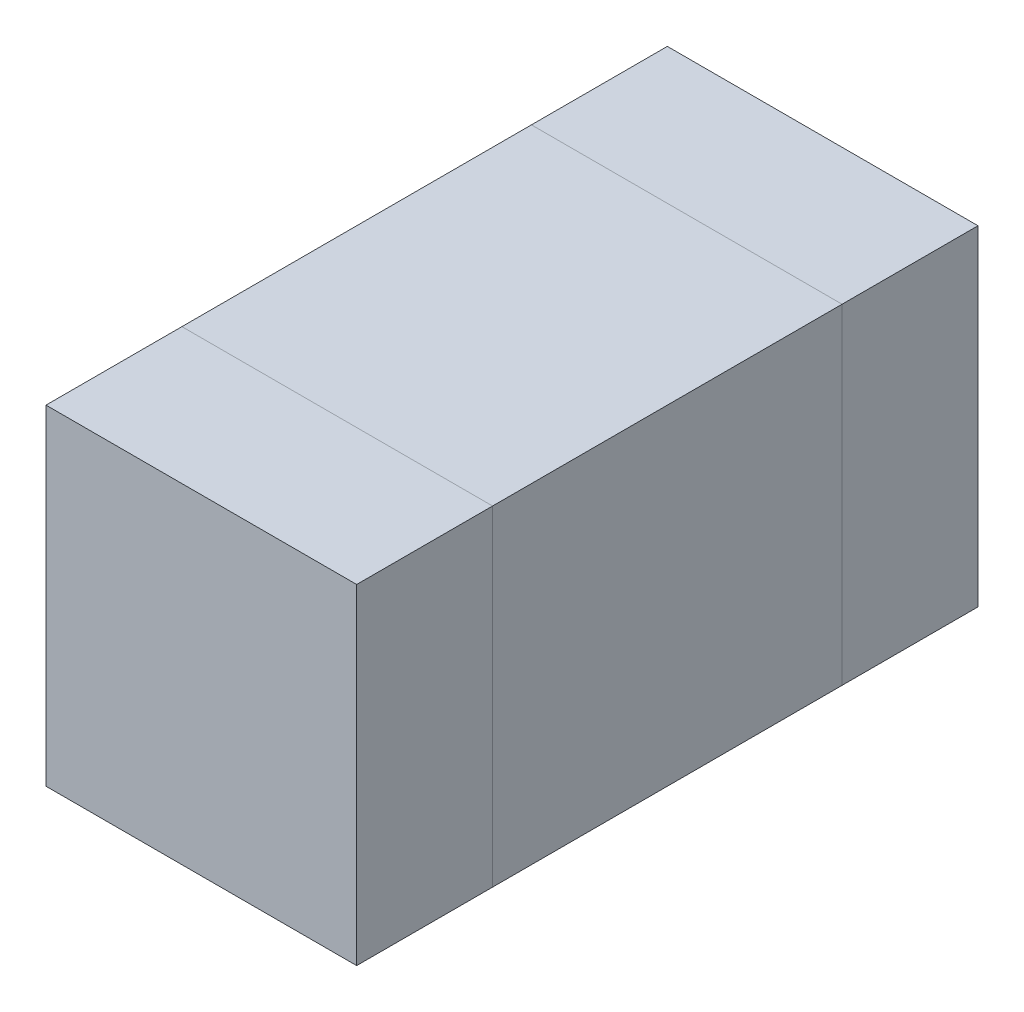
ISO-10303-21;
HEADER;
FILE_DESCRIPTION(('STEP AP214'),'2;1');
FILE_NAME('part.step','',(''),(''),'','','');
FILE_SCHEMA(('AUTOMOTIVE_DESIGN { 1 0 10303 214 1 1 1 1 }'));
ENDSEC;
DATA;
#1=APPLICATION_CONTEXT('core data for automotive mechanical design processes');
#2=APPLICATION_PROTOCOL_DEFINITION('international standard','automotive_design',2000,#1);
#3=PRODUCT_CONTEXT('',#1,'mechanical');
#4=PRODUCT('Part','Part','',(#3));
#5=PRODUCT_RELATED_PRODUCT_CATEGORY('part','',(#4));
#6=PRODUCT_DEFINITION_FORMATION('','',#4);
#7=PRODUCT_DEFINITION_CONTEXT('part definition',#1,'design');
#8=PRODUCT_DEFINITION('design','',#6,#7);
#9=PRODUCT_DEFINITION_SHAPE('','',#8);
#10=(LENGTH_UNIT() NAMED_UNIT(*) SI_UNIT(.MILLI.,.METRE.));
#11=(NAMED_UNIT(*) PLANE_ANGLE_UNIT() SI_UNIT($,.RADIAN.));
#12=(NAMED_UNIT(*) SI_UNIT($,.STERADIAN.) SOLID_ANGLE_UNIT());
#13=UNCERTAINTY_MEASURE_WITH_UNIT(LENGTH_MEASURE(1.E-05),#10,'distance_accuracy_value','');
#14=(GEOMETRIC_REPRESENTATION_CONTEXT(3) GLOBAL_UNCERTAINTY_ASSIGNED_CONTEXT((#13)) GLOBAL_UNIT_ASSIGNED_CONTEXT((#10,
#11,#12)) REPRESENTATION_CONTEXT('',''));
#15=CARTESIAN_POINT('',(0.,0.,0.));
#16=DIRECTION('',(0.,0.,1.));
#17=DIRECTION('',(1.,0.,0.));
#18=AXIS2_PLACEMENT_3D('',#15,#16,#17);
#19=CARTESIAN_POINT('',(0.8,1.7,-1.6));
#20=DIRECTION('',(-1.,0.,0.));
#21=DIRECTION('',(0.,0.,1.));
#22=AXIS2_PLACEMENT_3D('',#19,#20,#21);
#23=PLANE('',#22);
#24=DIRECTION('',(0.,-1.,0.));
#25=VECTOR('',#24,1.);
#26=CARTESIAN_POINT('',(0.8,1.7,-0.9));
#27=LINE('',#26,#25);
#28=CARTESIAN_POINT('',(0.8,1.7,-0.9));
#29=VERTEX_POINT('',#28);
#30=CARTESIAN_POINT('',(0.8,0.,-0.9));
#31=VERTEX_POINT('',#30);
#32=EDGE_CURVE('E107',#29,#31,#27,.T.);
#33=ORIENTED_EDGE('',*,*,#32,.T.);
#34=DIRECTION('',(0.,0.,1.));
#35=VECTOR('',#34,1.);
#36=CARTESIAN_POINT('',(0.8,0.,-1.6));
#37=LINE('',#36,#35);
#38=CARTESIAN_POINT('',(0.8,0.,-1.6));
#39=VERTEX_POINT('',#38);
#40=EDGE_CURVE('E12',#39,#31,#37,.T.);
#41=ORIENTED_EDGE('',*,*,#40,.F.);
#42=DIRECTION('',(0.,-1.,0.));
#43=VECTOR('',#42,1.);
#44=CARTESIAN_POINT('',(0.8,1.7,-1.6));
#45=LINE('',#44,#43);
#46=CARTESIAN_POINT('',(0.8,1.7,-1.6));
#47=VERTEX_POINT('',#46);
#48=EDGE_CURVE('E95',#47,#39,#45,.T.);
#49=ORIENTED_EDGE('',*,*,#48,.F.);
#50=DIRECTION('',(0.,0.,1.));
#51=VECTOR('',#50,1.);
#52=CARTESIAN_POINT('',(0.8,1.7,-1.6));
#53=LINE('',#52,#51);
#54=EDGE_CURVE('E103',#47,#29,#53,.T.);
#55=ORIENTED_EDGE('',*,*,#54,.T.);
#56=EDGE_LOOP('',(#33,#41,#49,#55));
#57=FACE_BOUND('',#56,.T.);
#58=ADVANCED_FACE('F44',(#57),#23,.F.);
#59=CARTESIAN_POINT('',(0.8,0.,-1.6));
#60=DIRECTION('',(0.,1.,0.));
#61=DIRECTION('',(0.,0.,1.));
#62=AXIS2_PLACEMENT_3D('',#59,#60,#61);
#63=PLANE('',#62);
#64=DIRECTION('',(-1.,0.,0.));
#65=VECTOR('',#64,1.);
#66=CARTESIAN_POINT('',(0.8,0.,-0.9));
#67=LINE('',#66,#65);
#68=CARTESIAN_POINT('',(-0.8,0.,-0.9));
#69=VERTEX_POINT('',#68);
#70=EDGE_CURVE('E99',#31,#69,#67,.T.);
#71=ORIENTED_EDGE('',*,*,#70,.T.);
#72=DIRECTION('',(0.,0.,1.));
#73=VECTOR('',#72,1.);
#74=CARTESIAN_POINT('',(-0.8,0.,-1.6));
#75=LINE('',#74,#73);
#76=CARTESIAN_POINT('',(-0.8,0.,-1.6));
#77=VERTEX_POINT('',#76);
#78=EDGE_CURVE('E52',#77,#69,#75,.T.);
#79=ORIENTED_EDGE('',*,*,#78,.F.);
#80=DIRECTION('',(-1.,0.,0.));
#81=VECTOR('',#80,1.);
#82=CARTESIAN_POINT('',(0.8,0.,-1.6));
#83=LINE('',#82,#81);
#84=EDGE_CURVE('E90',#39,#77,#83,.T.);
#85=ORIENTED_EDGE('',*,*,#84,.F.);
#86=ORIENTED_EDGE('',*,*,#40,.T.);
#87=EDGE_LOOP('',(#71,#79,#85,#86));
#88=FACE_BOUND('',#87,.T.);
#89=ADVANCED_FACE('F98',(#88),#63,.F.);
#90=CARTESIAN_POINT('',(-0.8,0.,-1.6));
#91=DIRECTION('',(1.,0.,0.));
#92=DIRECTION('',(0.,0.,-1.));
#93=AXIS2_PLACEMENT_3D('',#90,#91,#92);
#94=PLANE('',#93);
#95=DIRECTION('',(0.,1.,0.));
#96=VECTOR('',#95,1.);
#97=CARTESIAN_POINT('',(-0.8,0.,-0.9));
#98=LINE('',#97,#96);
#99=CARTESIAN_POINT('',(-0.8,1.7,-0.9));
#100=VERTEX_POINT('',#99);
#101=EDGE_CURVE('E77',#69,#100,#98,.T.);
#102=ORIENTED_EDGE('',*,*,#101,.T.);
#103=DIRECTION('',(0.,0.,1.));
#104=VECTOR('',#103,1.);
#105=CARTESIAN_POINT('',(-0.8,1.7,-1.6));
#106=LINE('',#105,#104);
#107=CARTESIAN_POINT('',(-0.8,1.7,-1.6));
#108=VERTEX_POINT('',#107);
#109=EDGE_CURVE('E100',#108,#100,#106,.T.);
#110=ORIENTED_EDGE('',*,*,#109,.F.);
#111=DIRECTION('',(0.,1.,0.));
#112=VECTOR('',#111,1.);
#113=CARTESIAN_POINT('',(-0.8,0.,-1.6));
#114=LINE('',#113,#112);
#115=EDGE_CURVE('E93',#77,#108,#114,.T.);
#116=ORIENTED_EDGE('',*,*,#115,.F.);
#117=ORIENTED_EDGE('',*,*,#78,.T.);
#118=EDGE_LOOP('',(#102,#110,#116,#117));
#119=FACE_BOUND('',#118,.T.);
#120=ADVANCED_FACE('F101',(#119),#94,.F.);
#121=CARTESIAN_POINT('',(-0.8,1.7,-1.6));
#122=DIRECTION('',(0.,-1.,0.));
#123=DIRECTION('',(0.,0.,-1.));
#124=AXIS2_PLACEMENT_3D('',#121,#122,#123);
#125=PLANE('',#124);
#126=DIRECTION('',(1.,0.,0.));
#127=VECTOR('',#126,1.);
#128=CARTESIAN_POINT('',(-0.8,1.7,-0.9));
#129=LINE('',#128,#127);
#130=EDGE_CURVE('E83',#100,#29,#129,.T.);
#131=ORIENTED_EDGE('',*,*,#130,.T.);
#132=ORIENTED_EDGE('',*,*,#54,.F.);
#133=DIRECTION('',(1.,0.,0.));
#134=VECTOR('',#133,1.);
#135=CARTESIAN_POINT('',(-0.8,1.7,-1.6));
#136=LINE('',#135,#134);
#137=EDGE_CURVE('E60',#108,#47,#136,.T.);
#138=ORIENTED_EDGE('',*,*,#137,.F.);
#139=ORIENTED_EDGE('',*,*,#109,.T.);
#140=EDGE_LOOP('',(#131,#132,#138,#139));
#141=FACE_BOUND('',#140,.T.);
#142=ADVANCED_FACE('F114',(#141),#125,.F.);
#143=CARTESIAN_POINT('',(0.,0.,-1.6));
#144=DIRECTION('',(0.,0.,-1.));
#145=DIRECTION('',(-1.,0.,0.));
#146=AXIS2_PLACEMENT_3D('',#143,#144,#145);
#147=PLANE('',#146);
#148=ORIENTED_EDGE('',*,*,#48,.T.);
#149=ORIENTED_EDGE('',*,*,#84,.T.);
#150=ORIENTED_EDGE('',*,*,#115,.T.);
#151=ORIENTED_EDGE('',*,*,#137,.T.);
#152=EDGE_LOOP('',(#148,#149,#150,#151));
#153=FACE_BOUND('',#152,.T.);
#154=ADVANCED_FACE('F91',(#153),#147,.T.);
#155=CARTESIAN_POINT('',(0.,0.,-0.9));
#156=DIRECTION('',(0.,0.,-1.));
#157=DIRECTION('',(-1.,0.,0.));
#158=AXIS2_PLACEMENT_3D('',#155,#156,#157);
#159=PLANE('',#158);
#160=ORIENTED_EDGE('',*,*,#32,.F.);
#161=ORIENTED_EDGE('',*,*,#130,.F.);
#162=ORIENTED_EDGE('',*,*,#101,.F.);
#163=ORIENTED_EDGE('',*,*,#70,.F.);
#164=EDGE_LOOP('',(#160,#161,#162,#163));
#165=FACE_BOUND('',#164,.T.);
#166=ADVANCED_FACE('F117',(#165),#159,.F.);
#167=CLOSED_SHELL('',(#58,#89,#120,#142,#154,#166));
#168=MANIFOLD_SOLID_BREP('B2',#167);
#169=CARTESIAN_POINT('',(-0.8,1.7,1.6));
#170=DIRECTION('',(1.,0.,0.));
#171=DIRECTION('',(0.,0.,-1.));
#172=AXIS2_PLACEMENT_3D('',#169,#170,#171);
#173=PLANE('',#172);
#174=DIRECTION('',(0.,-1.,0.));
#175=VECTOR('',#174,1.);
#176=CARTESIAN_POINT('',(-0.8,1.7,0.9));
#177=LINE('',#176,#175);
#178=CARTESIAN_POINT('',(-0.8,1.7,0.9));
#179=VERTEX_POINT('',#178);
#180=CARTESIAN_POINT('',(-0.8,0.,0.9));
#181=VERTEX_POINT('',#180);
#182=EDGE_CURVE('E240',#179,#181,#177,.T.);
#183=ORIENTED_EDGE('',*,*,#182,.T.);
#184=DIRECTION('',(0.,0.,-1.));
#185=VECTOR('',#184,1.);
#186=CARTESIAN_POINT('',(-0.8,0.,1.6));
#187=LINE('',#186,#185);
#188=CARTESIAN_POINT('',(-0.8,0.,1.6));
#189=VERTEX_POINT('',#188);
#190=EDGE_CURVE('E42',#189,#181,#187,.T.);
#191=ORIENTED_EDGE('',*,*,#190,.F.);
#192=DIRECTION('',(0.,-1.,0.));
#193=VECTOR('',#192,1.);
#194=CARTESIAN_POINT('',(-0.8,1.7,1.6));
#195=LINE('',#194,#193);
#196=CARTESIAN_POINT('',(-0.8,1.7,1.6));
#197=VERTEX_POINT('',#196);
#198=EDGE_CURVE('E228',#197,#189,#195,.T.);
#199=ORIENTED_EDGE('',*,*,#198,.F.);
#200=DIRECTION('',(0.,0.,-1.));
#201=VECTOR('',#200,1.);
#202=CARTESIAN_POINT('',(-0.8,1.7,1.6));
#203=LINE('',#202,#201);
#204=EDGE_CURVE('E236',#197,#179,#203,.T.);
#205=ORIENTED_EDGE('',*,*,#204,.T.);
#206=EDGE_LOOP('',(#183,#191,#199,#205));
#207=FACE_BOUND('',#206,.T.);
#208=ADVANCED_FACE('F177',(#207),#173,.F.);
#209=CARTESIAN_POINT('',(-0.8,0.,1.6));
#210=DIRECTION('',(0.,1.,0.));
#211=DIRECTION('',(0.,0.,1.));
#212=AXIS2_PLACEMENT_3D('',#209,#210,#211);
#213=PLANE('',#212);
#214=DIRECTION('',(1.,0.,0.));
#215=VECTOR('',#214,1.);
#216=CARTESIAN_POINT('',(-0.8,0.,0.9));
#217=LINE('',#216,#215);
#218=CARTESIAN_POINT('',(0.8,0.,0.9));
#219=VERTEX_POINT('',#218);
#220=EDGE_CURVE('E232',#181,#219,#217,.T.);
#221=ORIENTED_EDGE('',*,*,#220,.T.);
#222=DIRECTION('',(0.,0.,-1.));
#223=VECTOR('',#222,1.);
#224=CARTESIAN_POINT('',(0.8,0.,1.6));
#225=LINE('',#224,#223);
#226=CARTESIAN_POINT('',(0.8,0.,1.6));
#227=VERTEX_POINT('',#226);
#228=EDGE_CURVE('E185',#227,#219,#225,.T.);
#229=ORIENTED_EDGE('',*,*,#228,.F.);
#230=DIRECTION('',(1.,0.,0.));
#231=VECTOR('',#230,1.);
#232=CARTESIAN_POINT('',(-0.8,0.,1.6));
#233=LINE('',#232,#231);
#234=EDGE_CURVE('E223',#189,#227,#233,.T.);
#235=ORIENTED_EDGE('',*,*,#234,.F.);
#236=ORIENTED_EDGE('',*,*,#190,.T.);
#237=EDGE_LOOP('',(#221,#229,#235,#236));
#238=FACE_BOUND('',#237,.T.);
#239=ADVANCED_FACE('F231',(#238),#213,.F.);
#240=CARTESIAN_POINT('',(0.8,0.,1.6));
#241=DIRECTION('',(-1.,0.,0.));
#242=DIRECTION('',(0.,0.,1.));
#243=AXIS2_PLACEMENT_3D('',#240,#241,#242);
#244=PLANE('',#243);
#245=DIRECTION('',(0.,1.,0.));
#246=VECTOR('',#245,1.);
#247=CARTESIAN_POINT('',(0.8,0.,0.9));
#248=LINE('',#247,#246);
#249=CARTESIAN_POINT('',(0.8,1.7,0.9));
#250=VERTEX_POINT('',#249);
#251=EDGE_CURVE('E210',#219,#250,#248,.T.);
#252=ORIENTED_EDGE('',*,*,#251,.T.);
#253=DIRECTION('',(0.,0.,-1.));
#254=VECTOR('',#253,1.);
#255=CARTESIAN_POINT('',(0.8,1.7,1.6));
#256=LINE('',#255,#254);
#257=CARTESIAN_POINT('',(0.8,1.7,1.6));
#258=VERTEX_POINT('',#257);
#259=EDGE_CURVE('E233',#258,#250,#256,.T.);
#260=ORIENTED_EDGE('',*,*,#259,.F.);
#261=DIRECTION('',(0.,1.,0.));
#262=VECTOR('',#261,1.);
#263=CARTESIAN_POINT('',(0.8,0.,1.6));
#264=LINE('',#263,#262);
#265=EDGE_CURVE('E226',#227,#258,#264,.T.);
#266=ORIENTED_EDGE('',*,*,#265,.F.);
#267=ORIENTED_EDGE('',*,*,#228,.T.);
#268=EDGE_LOOP('',(#252,#260,#266,#267));
#269=FACE_BOUND('',#268,.T.);
#270=ADVANCED_FACE('F234',(#269),#244,.F.);
#271=CARTESIAN_POINT('',(0.8,1.7,1.6));
#272=DIRECTION('',(0.,-1.,0.));
#273=DIRECTION('',(0.,0.,-1.));
#274=AXIS2_PLACEMENT_3D('',#271,#272,#273);
#275=PLANE('',#274);
#276=DIRECTION('',(-1.,0.,0.));
#277=VECTOR('',#276,1.);
#278=CARTESIAN_POINT('',(0.8,1.7,0.9));
#279=LINE('',#278,#277);
#280=EDGE_CURVE('E216',#250,#179,#279,.T.);
#281=ORIENTED_EDGE('',*,*,#280,.T.);
#282=ORIENTED_EDGE('',*,*,#204,.F.);
#283=DIRECTION('',(-1.,0.,0.));
#284=VECTOR('',#283,1.);
#285=CARTESIAN_POINT('',(0.8,1.7,1.6));
#286=LINE('',#285,#284);
#287=EDGE_CURVE('E193',#258,#197,#286,.T.);
#288=ORIENTED_EDGE('',*,*,#287,.F.);
#289=ORIENTED_EDGE('',*,*,#259,.T.);
#290=EDGE_LOOP('',(#281,#282,#288,#289));
#291=FACE_BOUND('',#290,.T.);
#292=ADVANCED_FACE('F247',(#291),#275,.F.);
#293=CARTESIAN_POINT('',(0.,0.,1.6));
#294=DIRECTION('',(0.,0.,1.));
#295=DIRECTION('',(1.,0.,0.));
#296=AXIS2_PLACEMENT_3D('',#293,#294,#295);
#297=PLANE('',#296);
#298=ORIENTED_EDGE('',*,*,#198,.T.);
#299=ORIENTED_EDGE('',*,*,#234,.T.);
#300=ORIENTED_EDGE('',*,*,#265,.T.);
#301=ORIENTED_EDGE('',*,*,#287,.T.);
#302=EDGE_LOOP('',(#298,#299,#300,#301));
#303=FACE_BOUND('',#302,.T.);
#304=ADVANCED_FACE('F224',(#303),#297,.T.);
#305=CARTESIAN_POINT('',(0.,0.,0.9));
#306=DIRECTION('',(0.,0.,1.));
#307=DIRECTION('',(1.,0.,0.));
#308=AXIS2_PLACEMENT_3D('',#305,#306,#307);
#309=PLANE('',#308);
#310=ORIENTED_EDGE('',*,*,#182,.F.);
#311=ORIENTED_EDGE('',*,*,#280,.F.);
#312=ORIENTED_EDGE('',*,*,#251,.F.);
#313=ORIENTED_EDGE('',*,*,#220,.F.);
#314=EDGE_LOOP('',(#310,#311,#312,#313));
#315=FACE_BOUND('',#314,.T.);
#316=ADVANCED_FACE('F250',(#315),#309,.F.);
#317=CLOSED_SHELL('',(#208,#239,#270,#292,#304,#316));
#318=MANIFOLD_SOLID_BREP('B6',#317);
#319=CARTESIAN_POINT('',(0.8,1.7,-0.9));
#320=DIRECTION('',(-1.,0.,0.));
#321=DIRECTION('',(0.,0.,1.));
#322=AXIS2_PLACEMENT_3D('',#319,#320,#321);
#323=PLANE('',#322);
#324=DIRECTION('',(0.,0.,-1.));
#325=VECTOR('',#324,1.);
#326=CARTESIAN_POINT('',(0.8,0.,-0.9));
#327=LINE('',#326,#325);
#328=CARTESIAN_POINT('',(0.8,0.,0.9));
#329=VERTEX_POINT('',#328);
#330=CARTESIAN_POINT('',(0.8,0.,-0.9));
#331=VERTEX_POINT('',#330);
#332=EDGE_CURVE('E364',#329,#331,#327,.T.);
#333=ORIENTED_EDGE('',*,*,#332,.T.);
#334=DIRECTION('',(0.,-1.,0.));
#335=VECTOR('',#334,1.);
#336=CARTESIAN_POINT('',(0.8,1.7,-0.9));
#337=LINE('',#336,#335);
#338=CARTESIAN_POINT('',(0.8,1.7,-0.9));
#339=VERTEX_POINT('',#338);
#340=EDGE_CURVE('E175',#339,#331,#337,.T.);
#341=ORIENTED_EDGE('',*,*,#340,.F.);
#342=DIRECTION('',(0.,0.,-1.));
#343=VECTOR('',#342,1.);
#344=CARTESIAN_POINT('',(0.8,1.7,-0.9));
#345=LINE('',#344,#343);
#346=CARTESIAN_POINT('',(0.8,1.7,0.9));
#347=VERTEX_POINT('',#346);
#348=EDGE_CURVE('E352',#347,#339,#345,.T.);
#349=ORIENTED_EDGE('',*,*,#348,.F.);
#350=DIRECTION('',(0.,-1.,0.));
#351=VECTOR('',#350,1.);
#352=CARTESIAN_POINT('',(0.8,1.7,0.9));
#353=LINE('',#352,#351);
#354=EDGE_CURVE('E360',#347,#329,#353,.T.);
#355=ORIENTED_EDGE('',*,*,#354,.T.);
#356=EDGE_LOOP('',(#333,#341,#349,#355));
#357=FACE_BOUND('',#356,.T.);
#358=ADVANCED_FACE('F301',(#357),#323,.F.);
#359=CARTESIAN_POINT('',(-0.8,1.7,-0.9));
#360=DIRECTION('',(0.,0.,1.));
#361=DIRECTION('',(1.,0.,0.));
#362=AXIS2_PLACEMENT_3D('',#359,#360,#361);
#363=PLANE('',#362);
#364=DIRECTION('',(-1.,0.,0.));
#365=VECTOR('',#364,1.);
#366=CARTESIAN_POINT('',(-0.8,0.,-0.9));
#367=LINE('',#366,#365);
#368=CARTESIAN_POINT('',(-0.8,0.,-0.9));
#369=VERTEX_POINT('',#368);
#370=EDGE_CURVE('E356',#331,#369,#367,.T.);
#371=ORIENTED_EDGE('',*,*,#370,.T.);
#372=DIRECTION('',(0.,-1.,0.));
#373=VECTOR('',#372,1.);
#374=CARTESIAN_POINT('',(-0.8,1.7,-0.9));
#375=LINE('',#374,#373);
#376=CARTESIAN_POINT('',(-0.8,1.7,-0.9));
#377=VERTEX_POINT('',#376);
#378=EDGE_CURVE('E309',#377,#369,#375,.T.);
#379=ORIENTED_EDGE('',*,*,#378,.F.);
#380=DIRECTION('',(-1.,0.,0.));
#381=VECTOR('',#380,1.);
#382=CARTESIAN_POINT('',(-0.8,1.7,-0.9));
#383=LINE('',#382,#381);
#384=EDGE_CURVE('E347',#339,#377,#383,.T.);
#385=ORIENTED_EDGE('',*,*,#384,.F.);
#386=ORIENTED_EDGE('',*,*,#340,.T.);
#387=EDGE_LOOP('',(#371,#379,#385,#386));
#388=FACE_BOUND('',#387,.T.);
#389=ADVANCED_FACE('F355',(#388),#363,.F.);
#390=CARTESIAN_POINT('',(-0.8,1.7,-0.9));
#391=DIRECTION('',(1.,0.,0.));
#392=DIRECTION('',(0.,0.,-1.));
#393=AXIS2_PLACEMENT_3D('',#390,#391,#392);
#394=PLANE('',#393);
#395=DIRECTION('',(0.,0.,1.));
#396=VECTOR('',#395,1.);
#397=CARTESIAN_POINT('',(-0.8,0.,-0.9));
#398=LINE('',#397,#396);
#399=CARTESIAN_POINT('',(-0.8,0.,0.9));
#400=VERTEX_POINT('',#399);
#401=EDGE_CURVE('E334',#369,#400,#398,.T.);
#402=ORIENTED_EDGE('',*,*,#401,.T.);
#403=DIRECTION('',(0.,-1.,0.));
#404=VECTOR('',#403,1.);
#405=CARTESIAN_POINT('',(-0.8,1.7,0.9));
#406=LINE('',#405,#404);
#407=CARTESIAN_POINT('',(-0.8,1.7,0.9));
#408=VERTEX_POINT('',#407);
#409=EDGE_CURVE('E357',#408,#400,#406,.T.);
#410=ORIENTED_EDGE('',*,*,#409,.F.);
#411=DIRECTION('',(0.,0.,1.));
#412=VECTOR('',#411,1.);
#413=CARTESIAN_POINT('',(-0.8,1.7,-0.9));
#414=LINE('',#413,#412);
#415=EDGE_CURVE('E350',#377,#408,#414,.T.);
#416=ORIENTED_EDGE('',*,*,#415,.F.);
#417=ORIENTED_EDGE('',*,*,#378,.T.);
#418=EDGE_LOOP('',(#402,#410,#416,#417));
#419=FACE_BOUND('',#418,.T.);
#420=ADVANCED_FACE('F358',(#419),#394,.F.);
#421=CARTESIAN_POINT('',(-0.8,1.7,0.9));
#422=DIRECTION('',(0.,0.,-1.));
#423=DIRECTION('',(-1.,0.,0.));
#424=AXIS2_PLACEMENT_3D('',#421,#422,#423);
#425=PLANE('',#424);
#426=DIRECTION('',(1.,0.,0.));
#427=VECTOR('',#426,1.);
#428=CARTESIAN_POINT('',(-0.8,0.,0.9));
#429=LINE('',#428,#427);
#430=EDGE_CURVE('E340',#400,#329,#429,.T.);
#431=ORIENTED_EDGE('',*,*,#430,.T.);
#432=ORIENTED_EDGE('',*,*,#354,.F.);
#433=DIRECTION('',(1.,0.,0.));
#434=VECTOR('',#433,1.);
#435=CARTESIAN_POINT('',(-0.8,1.7,0.9));
#436=LINE('',#435,#434);
#437=EDGE_CURVE('E317',#408,#347,#436,.T.);
#438=ORIENTED_EDGE('',*,*,#437,.F.);
#439=ORIENTED_EDGE('',*,*,#409,.T.);
#440=EDGE_LOOP('',(#431,#432,#438,#439));
#441=FACE_BOUND('',#440,.T.);
#442=ADVANCED_FACE('F371',(#441),#425,.F.);
#443=CARTESIAN_POINT('',(0.,1.7,0.));
#444=DIRECTION('',(0.,1.,0.));
#445=DIRECTION('',(0.,0.,1.));
#446=AXIS2_PLACEMENT_3D('',#443,#444,#445);
#447=PLANE('',#446);
#448=ORIENTED_EDGE('',*,*,#348,.T.);
#449=ORIENTED_EDGE('',*,*,#384,.T.);
#450=ORIENTED_EDGE('',*,*,#415,.T.);
#451=ORIENTED_EDGE('',*,*,#437,.T.);
#452=EDGE_LOOP('',(#448,#449,#450,#451));
#453=FACE_BOUND('',#452,.T.);
#454=ADVANCED_FACE('F348',(#453),#447,.T.);
#455=CARTESIAN_POINT('',(0.,0.,0.));
#456=DIRECTION('',(0.,1.,0.));
#457=DIRECTION('',(0.,0.,1.));
#458=AXIS2_PLACEMENT_3D('',#455,#456,#457);
#459=PLANE('',#458);
#460=ORIENTED_EDGE('',*,*,#332,.F.);
#461=ORIENTED_EDGE('',*,*,#430,.F.);
#462=ORIENTED_EDGE('',*,*,#401,.F.);
#463=ORIENTED_EDGE('',*,*,#370,.F.);
#464=EDGE_LOOP('',(#460,#461,#462,#463));
#465=FACE_BOUND('',#464,.T.);
#466=ADVANCED_FACE('F374',(#465),#459,.F.);
#467=CLOSED_SHELL('',(#358,#389,#420,#442,#454,#466));
#468=MANIFOLD_SOLID_BREP('B36',#467);
#469=ADVANCED_BREP_SHAPE_REPRESENTATION('',(#18,#168,#318,#468),#14);
#470=SHAPE_DEFINITION_REPRESENTATION(#9,#469);
ENDSEC;
END-ISO-10303-21;
